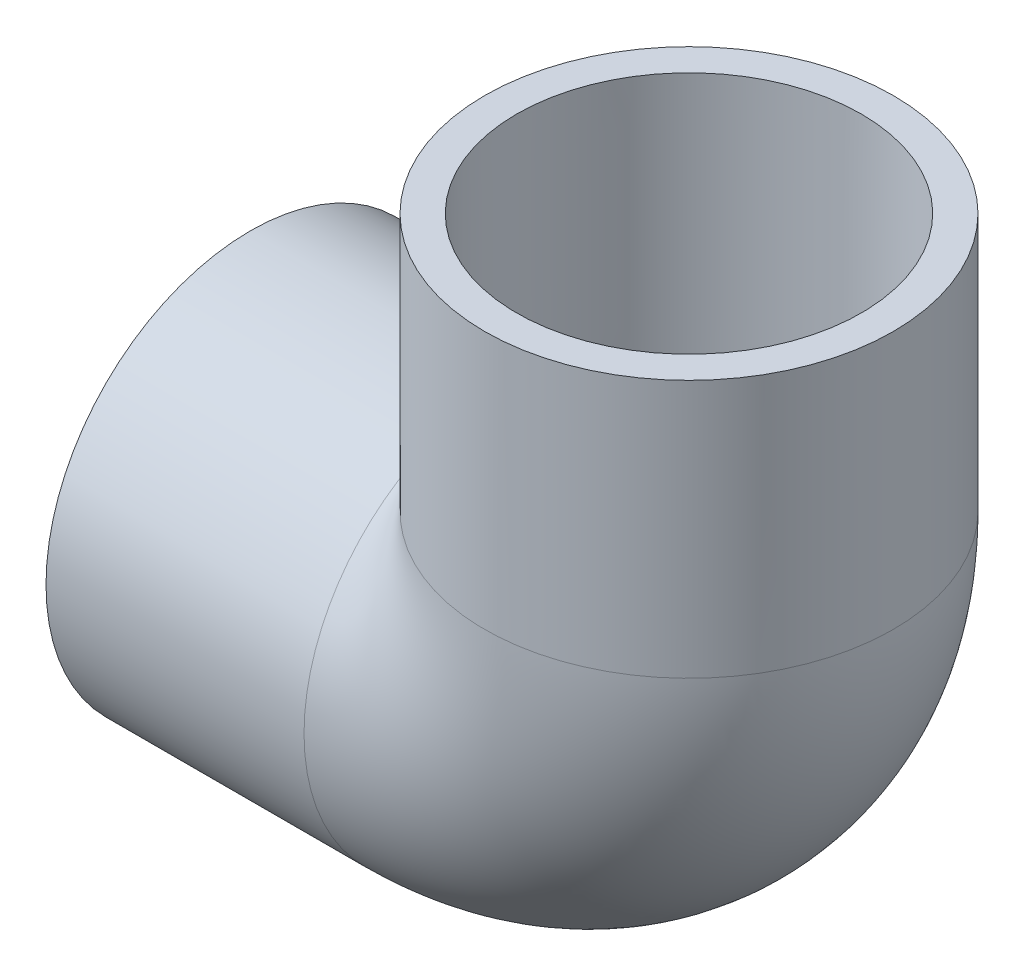
ISO-10303-21;
HEADER;
FILE_DESCRIPTION(('STEP AP214'),'2;1');
FILE_NAME('part.step','',(''),(''),'','','');
FILE_SCHEMA(('AUTOMOTIVE_DESIGN { 1 0 10303 214 1 1 1 1 }'));
ENDSEC;
DATA;
#1=APPLICATION_CONTEXT('core data for automotive mechanical design processes');
#2=APPLICATION_PROTOCOL_DEFINITION('international standard','automotive_design',2000,#1);
#3=PRODUCT_CONTEXT('',#1,'mechanical');
#4=PRODUCT('Part','Part','',(#3));
#5=PRODUCT_RELATED_PRODUCT_CATEGORY('part','',(#4));
#6=PRODUCT_DEFINITION_FORMATION('','',#4);
#7=PRODUCT_DEFINITION_CONTEXT('part definition',#1,'design');
#8=PRODUCT_DEFINITION('design','',#6,#7);
#9=PRODUCT_DEFINITION_SHAPE('','',#8);
#10=(LENGTH_UNIT() NAMED_UNIT(*) SI_UNIT(.MILLI.,.METRE.));
#11=(NAMED_UNIT(*) PLANE_ANGLE_UNIT() SI_UNIT($,.RADIAN.));
#12=(NAMED_UNIT(*) SI_UNIT($,.STERADIAN.) SOLID_ANGLE_UNIT());
#13=UNCERTAINTY_MEASURE_WITH_UNIT(LENGTH_MEASURE(1.E-05),#10,'distance_accuracy_value','');
#14=(GEOMETRIC_REPRESENTATION_CONTEXT(3) GLOBAL_UNCERTAINTY_ASSIGNED_CONTEXT((#13)) GLOBAL_UNIT_ASSIGNED_CONTEXT((#10,
#11,#12)) REPRESENTATION_CONTEXT('',''));
#15=CARTESIAN_POINT('',(0.,0.,0.));
#16=DIRECTION('',(0.,0.,1.));
#17=DIRECTION('',(1.,0.,0.));
#18=AXIS2_PLACEMENT_3D('',#15,#16,#17);
#19=CARTESIAN_POINT('',(-53.975,-25.146,0.));
#20=DIRECTION('',(-1.,0.,0.));
#21=DIRECTION('',(0.,0.,1.));
#22=AXIS2_PLACEMENT_3D('',#19,#20,#21);
#23=PLANE('',#22);
#24=CARTESIAN_POINT('',(-53.975,0.,0.));
#25=DIRECTION('',(-1.,0.,0.));
#26=DIRECTION('',(0.,0.,1.));
#27=AXIS2_PLACEMENT_3D('',#24,#25,#26);
#28=CIRCLE('',#27,25.146);
#29=CARTESIAN_POINT('',(-53.975,0.,25.146));
#30=VERTEX_POINT('',#29);
#31=EDGE_CURVE('E51',#30,#30,#28,.T.);
#32=ORIENTED_EDGE('',*,*,#31,.T.);
#33=EDGE_LOOP('',(#32));
#34=FACE_BOUND('',#33,.T.);
#35=CARTESIAN_POINT('',(-53.975,0.,0.));
#36=DIRECTION('',(-1.,0.,0.));
#37=DIRECTION('',(0.,0.,1.));
#38=AXIS2_PLACEMENT_3D('',#35,#36,#37);
#39=CIRCLE('',#38,21.209);
#40=CARTESIAN_POINT('',(-53.975,0.,21.209));
#41=VERTEX_POINT('',#40);
#42=EDGE_CURVE('E38',#41,#41,#39,.T.);
#43=ORIENTED_EDGE('',*,*,#42,.F.);
#44=EDGE_LOOP('',(#43));
#45=FACE_BOUND('',#44,.T.);
#46=ADVANCED_FACE('F31',(#34,#45),#23,.T.);
#47=CARTESIAN_POINT('',(-22.225,0.,0.));
#48=DIRECTION('',(-1.,0.,0.));
#49=DIRECTION('',(0.,0.,1.));
#50=AXIS2_PLACEMENT_3D('',#47,#48,#49);
#51=CONICAL_SURFACE('',#50,21.0185,0.00599992800155515);
#52=ORIENTED_EDGE('',*,*,#42,.T.);
#53=EDGE_LOOP('',(#52));
#54=FACE_BOUND('',#53,.T.);
#55=CARTESIAN_POINT('',(-22.225,0.,0.));
#56=DIRECTION('',(-1.,0.,0.));
#57=DIRECTION('',(0.,0.,1.));
#58=AXIS2_PLACEMENT_3D('',#55,#56,#57);
#59=CIRCLE('',#58,21.0185);
#60=CARTESIAN_POINT('',(-22.225,0.,21.0185));
#61=VERTEX_POINT('',#60);
#62=EDGE_CURVE('E62',#61,#61,#59,.T.);
#63=ORIENTED_EDGE('',*,*,#62,.F.);
#64=EDGE_LOOP('',(#63));
#65=FACE_BOUND('',#64,.T.);
#66=ADVANCED_FACE('F71',(#54,#65),#51,.F.);
#67=CARTESIAN_POINT('',(-53.975,0.,0.));
#68=DIRECTION('',(-1.,0.,0.));
#69=DIRECTION('',(0.,0.,1.));
#70=AXIS2_PLACEMENT_3D('',#67,#68,#69);
#71=CYLINDRICAL_SURFACE('',#70,25.146);
#72=CARTESIAN_POINT('',(0.,0.,0.));
#73=DIRECTION('',(-0.707106781186547,-0.707106781186547,0.));
#74=DIRECTION('',(-0.707106781186547,0.707106781186547,0.));
#75=AXIS2_PLACEMENT_3D('',#72,#73,#74);
#76=ELLIPSE('',#75,35.5618142394338,25.146);
#77=CARTESIAN_POINT('',(-22.225,22.225,-11.7631072000556));
#78=VERTEX_POINT('',#77);
#79=CARTESIAN_POINT('',(-22.225,22.225,11.7631072000556));
#80=VERTEX_POINT('',#79);
#81=EDGE_CURVE('E50',#78,#80,#76,.F.);
#82=ORIENTED_EDGE('',*,*,#81,.F.);
#83=CARTESIAN_POINT('',(-22.225,0.,0.));
#84=DIRECTION('',(-1.,0.,0.));
#85=DIRECTION('',(0.,0.,1.));
#86=AXIS2_PLACEMENT_3D('',#83,#84,#85);
#87=CIRCLE('',#86,25.146);
#88=EDGE_CURVE('E57',#78,#80,#87,.T.);
#89=ORIENTED_EDGE('',*,*,#88,.T.);
#90=EDGE_LOOP('',(#82,#89));
#91=FACE_BOUND('',#90,.T.);
#92=ORIENTED_EDGE('',*,*,#31,.F.);
#93=EDGE_LOOP('',(#92));
#94=FACE_BOUND('',#93,.T.);
#95=ADVANCED_FACE('F55',(#91,#94),#71,.T.);
#96=CARTESIAN_POINT('',(-22.225,22.225,0.));
#97=DIRECTION('',(0.,0.,-1.));
#98=DIRECTION('',(-1.,0.,0.));
#99=AXIS2_PLACEMENT_3D('',#96,#97,#98);
#100=TOROIDAL_SURFACE('',#99,22.225,17.526);
#101=CARTESIAN_POINT('',(0.,22.225,0.));
#102=DIRECTION('',(0.,1.,0.));
#103=DIRECTION('',(0.,0.,-1.));
#104=AXIS2_PLACEMENT_3D('',#101,#102,#103);
#105=CIRCLE('',#104,17.526);
#106=CARTESIAN_POINT('',(17.526,22.225,0.));
#107=VERTEX_POINT('',#106);
#108=EDGE_CURVE('E52',#107,#107,#105,.T.);
#109=CARTESIAN_POINT('',(-22.225,0.,0.));
#110=DIRECTION('',(1.,0.,0.));
#111=DIRECTION('',(0.,0.,-1.));
#112=AXIS2_PLACEMENT_3D('',#109,#110,#111);
#113=CIRCLE('',#112,17.526);
#114=CARTESIAN_POINT('',(-22.225,-17.526,0.));
#115=VERTEX_POINT('',#114);
#116=EDGE_CURVE('E58',#115,#115,#113,.T.);
#117=CARTESIAN_POINT('',(-22.225,22.225,0.));
#118=DIRECTION('',(0.,0.,-1.));
#119=DIRECTION('',(-1.,0.,0.));
#120=AXIS2_PLACEMENT_3D('',#117,#118,#119);
#121=CIRCLE('',#120,39.751);
#122=EDGE_CURVE('',#107,#115,#121,.T.);
#123=ORIENTED_EDGE('',*,*,#108,.T.);
#124=ORIENTED_EDGE('',*,*,#116,.F.);
#125=ORIENTED_EDGE('',*,*,#122,.T.);
#126=ORIENTED_EDGE('',*,*,#122,.F.);
#127=EDGE_LOOP('',(#123,#125,#124,#126));
#128=FACE_BOUND('',#127,.T.);
#129=ADVANCED_FACE('F81',(#128),#100,.F.);
#130=CARTESIAN_POINT('',(-44.45,22.225,0.));
#131=DIRECTION('',(0.,-1.,0.));
#132=DIRECTION('',(-1.,0.,0.));
#133=AXIS2_PLACEMENT_3D('',#130,#131,#132);
#134=CIRCLE('',#133,25.146);
#135=TRIMMED_CURVE('',#134,(PARAMETER_VALUE(-2.6548012951665)),
(PARAMETER_VALUE(2.6548012951665)),.T.,.PARAMETER.);
#136=CARTESIAN_POINT('',(-22.225,22.225,0.));
#137=DIRECTION('',(0.,0.,-1.));
#138=AXIS1_PLACEMENT('',#136,#137);
#139=SURFACE_OF_REVOLUTION('',#135,#138);
#140=CARTESIAN_POINT('',(0.,22.225,0.));
#141=DIRECTION('',(0.,1.,0.));
#142=DIRECTION('',(0.,0.,-1.));
#143=AXIS2_PLACEMENT_3D('',#140,#141,#142);
#144=CIRCLE('',#143,25.146);
#145=EDGE_CURVE('E44',#80,#78,#144,.T.);
#146=ORIENTED_EDGE('',*,*,#145,.F.);
#147=ORIENTED_EDGE('',*,*,#88,.F.);
#148=EDGE_LOOP('',(#146,#147));
#149=FACE_BOUND('',#148,.T.);
#150=ADVANCED_FACE('F61',(#149),#139,.T.);
#151=CARTESIAN_POINT('',(0.,22.225,0.));
#152=DIRECTION('',(0.,1.,0.));
#153=DIRECTION('',(0.,0.,-1.));
#154=AXIS2_PLACEMENT_3D('',#151,#152,#153);
#155=PLANE('',#154);
#156=CARTESIAN_POINT('',(0.,22.225,0.));
#157=DIRECTION('',(0.,1.,0.));
#158=DIRECTION('',(-1.,0.,0.));
#159=AXIS2_PLACEMENT_3D('',#156,#157,#158);
#160=CIRCLE('',#159,21.0185);
#161=CARTESIAN_POINT('',(-21.0185,22.225,0.));
#162=VERTEX_POINT('',#161);
#163=EDGE_CURVE('E11',#162,#162,#160,.F.);
#164=ORIENTED_EDGE('',*,*,#163,.F.);
#165=EDGE_LOOP('',(#164));
#166=FACE_BOUND('',#165,.T.);
#167=ORIENTED_EDGE('',*,*,#108,.F.);
#168=EDGE_LOOP('',(#167));
#169=FACE_BOUND('',#168,.T.);
#170=ADVANCED_FACE('F88',(#166,#169),#155,.T.);
#171=CARTESIAN_POINT('',(-22.225,0.,0.));
#172=DIRECTION('',(1.,0.,0.));
#173=DIRECTION('',(0.,0.,-1.));
#174=AXIS2_PLACEMENT_3D('',#171,#172,#173);
#175=PLANE('',#174);
#176=ORIENTED_EDGE('',*,*,#62,.T.);
#177=EDGE_LOOP('',(#176));
#178=FACE_BOUND('',#177,.T.);
#179=ORIENTED_EDGE('',*,*,#116,.T.);
#180=EDGE_LOOP('',(#179));
#181=FACE_BOUND('',#180,.T.);
#182=ADVANCED_FACE('F91',(#178,#181),#175,.F.);
#183=CARTESIAN_POINT('',(25.146,53.975,0.));
#184=DIRECTION('',(0.,1.,0.));
#185=DIRECTION('',(0.,0.,1.));
#186=AXIS2_PLACEMENT_3D('',#183,#184,#185);
#187=PLANE('',#186);
#188=CARTESIAN_POINT('',(0.,53.975,0.));
#189=DIRECTION('',(0.,-1.,0.));
#190=DIRECTION('',(0.,0.,-1.));
#191=AXIS2_PLACEMENT_3D('',#188,#189,#190);
#192=CIRCLE('',#191,21.209);
#193=CARTESIAN_POINT('',(0.,53.975,-21.209));
#194=VERTEX_POINT('',#193);
#195=EDGE_CURVE('E115',#194,#194,#192,.T.);
#196=ORIENTED_EDGE('',*,*,#195,.T.);
#197=EDGE_LOOP('',(#196));
#198=FACE_BOUND('',#197,.T.);
#199=CARTESIAN_POINT('',(0.,53.975,0.));
#200=DIRECTION('',(0.,-1.,0.));
#201=DIRECTION('',(0.,0.,-1.));
#202=AXIS2_PLACEMENT_3D('',#199,#200,#201);
#203=CIRCLE('',#202,25.146);
#204=CARTESIAN_POINT('',(0.,53.975,-25.146));
#205=VERTEX_POINT('',#204);
#206=EDGE_CURVE('E59',#205,#205,#203,.T.);
#207=ORIENTED_EDGE('',*,*,#206,.F.);
#208=EDGE_LOOP('',(#207));
#209=FACE_BOUND('',#208,.T.);
#210=ADVANCED_FACE('F98',(#198,#209),#187,.T.);
#211=CARTESIAN_POINT('',(0.,0.,0.));
#212=DIRECTION('',(0.,-1.,0.));
#213=DIRECTION('',(0.,0.,-1.));
#214=AXIS2_PLACEMENT_3D('',#211,#212,#213);
#215=CYLINDRICAL_SURFACE('',#214,25.146);
#216=ORIENTED_EDGE('',*,*,#206,.T.);
#217=EDGE_LOOP('',(#216));
#218=FACE_BOUND('',#217,.T.);
#219=ORIENTED_EDGE('',*,*,#145,.T.);
#220=ORIENTED_EDGE('',*,*,#81,.T.);
#221=EDGE_LOOP('',(#219,#220));
#222=FACE_BOUND('',#221,.T.);
#223=ADVANCED_FACE('F49',(#218,#222),#215,.T.);
#224=CARTESIAN_POINT('',(0.,53.975,0.));
#225=DIRECTION('',(0.,1.,0.));
#226=DIRECTION('',(0.,0.,1.));
#227=AXIS2_PLACEMENT_3D('',#224,#225,#226);
#228=CONICAL_SURFACE('',#227,21.209,0.00599992800155515);
#229=ORIENTED_EDGE('',*,*,#163,.T.);
#230=EDGE_LOOP('',(#229));
#231=FACE_BOUND('',#230,.T.);
#232=ORIENTED_EDGE('',*,*,#195,.F.);
#233=EDGE_LOOP('',(#232));
#234=FACE_BOUND('',#233,.T.);
#235=ADVANCED_FACE('F105',(#231,#234),#228,.F.);
#236=CLOSED_SHELL('',(#46,#66,#95,#129,#150,#170,#182,#210,#223,#235));
#237=MANIFOLD_SOLID_BREP('B2',#236);
#238=ADVANCED_BREP_SHAPE_REPRESENTATION('',(#18,#237),#14);
#239=SHAPE_DEFINITION_REPRESENTATION(#9,#238);
ENDSEC;
END-ISO-10303-21;
